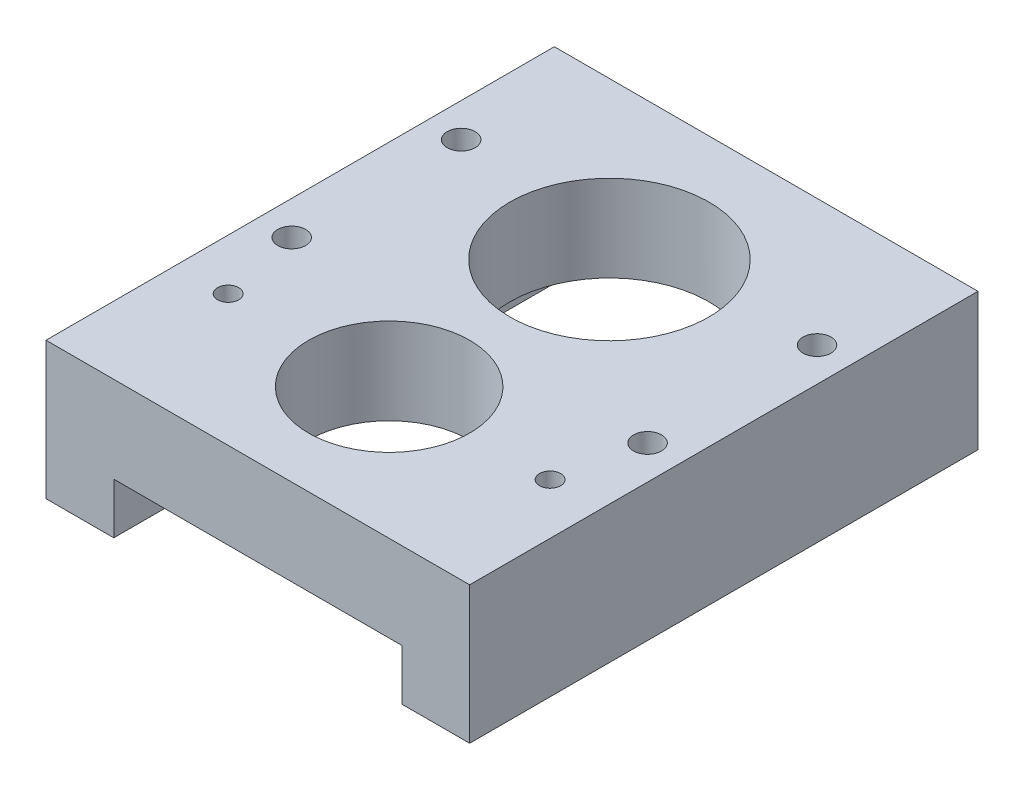
ISO-10303-21;
HEADER;
FILE_DESCRIPTION(('STEP AP214'),'2;1');
FILE_NAME('part.step','',(''),(''),'','','');
FILE_SCHEMA(('AUTOMOTIVE_DESIGN { 1 0 10303 214 1 1 1 1 }'));
ENDSEC;
DATA;
#1=APPLICATION_CONTEXT('core data for automotive mechanical design processes');
#2=APPLICATION_PROTOCOL_DEFINITION('international standard','automotive_design',2000,#1);
#3=PRODUCT_CONTEXT('',#1,'mechanical');
#4=PRODUCT('Part','Part','',(#3));
#5=PRODUCT_RELATED_PRODUCT_CATEGORY('part','',(#4));
#6=PRODUCT_DEFINITION_FORMATION('','',#4);
#7=PRODUCT_DEFINITION_CONTEXT('part definition',#1,'design');
#8=PRODUCT_DEFINITION('design','',#6,#7);
#9=PRODUCT_DEFINITION_SHAPE('','',#8);
#10=(LENGTH_UNIT() NAMED_UNIT(*) SI_UNIT(.MILLI.,.METRE.));
#11=(NAMED_UNIT(*) PLANE_ANGLE_UNIT() SI_UNIT($,.RADIAN.));
#12=(NAMED_UNIT(*) SI_UNIT($,.STERADIAN.) SOLID_ANGLE_UNIT());
#13=UNCERTAINTY_MEASURE_WITH_UNIT(LENGTH_MEASURE(1.E-05),#10,'distance_accuracy_value','');
#14=(GEOMETRIC_REPRESENTATION_CONTEXT(3) GLOBAL_UNCERTAINTY_ASSIGNED_CONTEXT((#13)) GLOBAL_UNIT_ASSIGNED_CONTEXT((#10,
#11,#12)) REPRESENTATION_CONTEXT('',''));
#15=CARTESIAN_POINT('',(0.,0.,0.));
#16=DIRECTION('',(0.,0.,1.));
#17=DIRECTION('',(1.,0.,0.));
#18=AXIS2_PLACEMENT_3D('',#15,#16,#17);
#19=CARTESIAN_POINT('',(-25.,16.2,60.));
#20=DIRECTION('',(1.,0.,0.));
#21=DIRECTION('',(0.,1.,0.));
#22=AXIS2_PLACEMENT_3D('',#19,#20,#21);
#23=PLANE('',#22);
#24=DIRECTION('',(0.,-1.,0.));
#25=VECTOR('',#24,1.);
#26=CARTESIAN_POINT('',(-25.,16.2,0.));
#27=LINE('',#26,#25);
#28=CARTESIAN_POINT('',(-25.,16.2,0.));
#29=VERTEX_POINT('',#28);
#30=CARTESIAN_POINT('',(-25.,0.,0.));
#31=VERTEX_POINT('',#30);
#32=EDGE_CURVE('E136',#29,#31,#27,.T.);
#33=ORIENTED_EDGE('',*,*,#32,.T.);
#34=DIRECTION('',(0.,0.,-1.));
#35=VECTOR('',#34,1.);
#36=CARTESIAN_POINT('',(-25.,0.,60.));
#37=LINE('',#36,#35);
#38=CARTESIAN_POINT('',(-25.,0.,60.));
#39=VERTEX_POINT('',#38);
#40=EDGE_CURVE('E11',#39,#31,#37,.T.);
#41=ORIENTED_EDGE('',*,*,#40,.F.);
#42=DIRECTION('',(0.,-1.,0.));
#43=VECTOR('',#42,1.);
#44=CARTESIAN_POINT('',(-25.,16.2,60.));
#45=LINE('',#44,#43);
#46=CARTESIAN_POINT('',(-25.,16.2,60.));
#47=VERTEX_POINT('',#46);
#48=EDGE_CURVE('E151',#47,#39,#45,.T.);
#49=ORIENTED_EDGE('',*,*,#48,.F.);
#50=DIRECTION('',(0.,0.,-1.));
#51=VECTOR('',#50,1.);
#52=CARTESIAN_POINT('',(-25.,16.2,60.));
#53=LINE('',#52,#51);
#54=EDGE_CURVE('E132',#47,#29,#53,.T.);
#55=ORIENTED_EDGE('',*,*,#54,.T.);
#56=EDGE_LOOP('',(#33,#41,#49,#55));
#57=FACE_BOUND('',#56,.T.);
#58=ADVANCED_FACE('F37',(#57),#23,.F.);
#59=CARTESIAN_POINT('',(-25.,0.,60.));
#60=DIRECTION('',(0.,1.,0.));
#61=DIRECTION('',(0.,0.,1.));
#62=AXIS2_PLACEMENT_3D('',#59,#60,#61);
#63=PLANE('',#62);
#64=CARTESIAN_POINT('',(-21.,0.,15.));
#65=DIRECTION('',(0.,1.,0.));
#66=DIRECTION('',(0.,0.,1.));
#67=AXIS2_PLACEMENT_3D('',#64,#65,#66);
#68=CIRCLE('',#67,1.65);
#69=CARTESIAN_POINT('',(-21.,0.,16.65));
#70=VERTEX_POINT('',#69);
#71=EDGE_CURVE('E213',#70,#70,#68,.F.);
#72=ORIENTED_EDGE('',*,*,#71,.F.);
#73=EDGE_LOOP('',(#72));
#74=FACE_BOUND('',#73,.T.);
#75=CARTESIAN_POINT('',(-21.,0.,35.));
#76=DIRECTION('',(0.,1.,0.));
#77=DIRECTION('',(0.,0.,1.));
#78=AXIS2_PLACEMENT_3D('',#75,#76,#77);
#79=CIRCLE('',#78,1.65);
#80=CARTESIAN_POINT('',(-21.,0.,36.65));
#81=VERTEX_POINT('',#80);
#82=EDGE_CURVE('E207',#81,#81,#79,.F.);
#83=ORIENTED_EDGE('',*,*,#82,.F.);
#84=EDGE_LOOP('',(#83));
#85=FACE_BOUND('',#84,.T.);
#86=DIRECTION('',(1.,0.,0.));
#87=VECTOR('',#86,1.);
#88=CARTESIAN_POINT('',(-25.,0.,0.));
#89=LINE('',#88,#87);
#90=CARTESIAN_POINT('',(-17.,0.,0.));
#91=VERTEX_POINT('',#90);
#92=EDGE_CURVE('E139',#31,#91,#89,.T.);
#93=ORIENTED_EDGE('',*,*,#92,.T.);
#94=DIRECTION('',(0.,0.,-1.));
#95=VECTOR('',#94,1.);
#96=CARTESIAN_POINT('',(-17.,0.,60.));
#97=LINE('',#96,#95);
#98=CARTESIAN_POINT('',(-17.,0.,60.));
#99=VERTEX_POINT('',#98);
#100=EDGE_CURVE('E45',#99,#91,#97,.T.);
#101=ORIENTED_EDGE('',*,*,#100,.F.);
#102=DIRECTION('',(1.,0.,0.));
#103=VECTOR('',#102,1.);
#104=CARTESIAN_POINT('',(-25.,0.,60.));
#105=LINE('',#104,#103);
#106=EDGE_CURVE('E97',#39,#99,#105,.T.);
#107=ORIENTED_EDGE('',*,*,#106,.F.);
#108=ORIENTED_EDGE('',*,*,#40,.T.);
#109=EDGE_LOOP('',(#93,#101,#107,#108));
#110=FACE_BOUND('',#109,.T.);
#111=ADVANCED_FACE('F265',(#74,#85,#110),#63,.F.);
#112=CARTESIAN_POINT('',(-17.,0.,60.));
#113=DIRECTION('',(-1.,0.,0.));
#114=DIRECTION('',(0.,0.,1.));
#115=AXIS2_PLACEMENT_3D('',#112,#113,#114);
#116=PLANE('',#115);
#117=DIRECTION('',(0.,1.,0.));
#118=VECTOR('',#117,1.);
#119=CARTESIAN_POINT('',(-17.,0.,0.));
#120=LINE('',#119,#118);
#121=CARTESIAN_POINT('',(-17.,6.,0.));
#122=VERTEX_POINT('',#121);
#123=EDGE_CURVE('E142',#91,#122,#120,.T.);
#124=ORIENTED_EDGE('',*,*,#123,.T.);
#125=DIRECTION('',(0.,0.,-1.));
#126=VECTOR('',#125,1.);
#127=CARTESIAN_POINT('',(-17.,6.,60.));
#128=LINE('',#127,#126);
#129=CARTESIAN_POINT('',(-17.,6.,60.));
#130=VERTEX_POINT('',#129);
#131=EDGE_CURVE('E158',#130,#122,#128,.T.);
#132=ORIENTED_EDGE('',*,*,#131,.F.);
#133=DIRECTION('',(0.,1.,0.));
#134=VECTOR('',#133,1.);
#135=CARTESIAN_POINT('',(-17.,0.,60.));
#136=LINE('',#135,#134);
#137=EDGE_CURVE('E166',#99,#130,#136,.T.);
#138=ORIENTED_EDGE('',*,*,#137,.F.);
#139=ORIENTED_EDGE('',*,*,#100,.T.);
#140=EDGE_LOOP('',(#124,#132,#138,#139));
#141=FACE_BOUND('',#140,.T.);
#142=ADVANCED_FACE('F164',(#141),#116,.F.);
#143=CARTESIAN_POINT('',(-17.,6.,60.));
#144=DIRECTION('',(0.,1.,0.));
#145=DIRECTION('',(0.,0.,1.));
#146=AXIS2_PLACEMENT_3D('',#143,#144,#145);
#147=PLANE('',#146);
#148=CARTESIAN_POINT('',(0.,6.,44.5));
#149=DIRECTION('',(0.,1.,0.));
#150=DIRECTION('',(0.,0.,1.));
#151=AXIS2_PLACEMENT_3D('',#148,#149,#150);
#152=CIRCLE('',#151,9.5);
#153=CARTESIAN_POINT('',(0.,6.,54.));
#154=VERTEX_POINT('',#153);
#155=EDGE_CURVE('E189',#154,#154,#152,.T.);
#156=ORIENTED_EDGE('',*,*,#155,.T.);
#157=EDGE_LOOP('',(#156));
#158=FACE_BOUND('',#157,.T.);
#159=CARTESIAN_POINT('',(0.,6.,18.5));
#160=DIRECTION('',(0.,1.,0.));
#161=DIRECTION('',(0.,0.,1.));
#162=AXIS2_PLACEMENT_3D('',#159,#160,#161);
#163=CIRCLE('',#162,11.75);
#164=CARTESIAN_POINT('',(0.,6.,30.25));
#165=VERTEX_POINT('',#164);
#166=EDGE_CURVE('E140',#165,#165,#163,.T.);
#167=ORIENTED_EDGE('',*,*,#166,.T.);
#168=EDGE_LOOP('',(#167));
#169=FACE_BOUND('',#168,.T.);
#170=DIRECTION('',(1.,0.,0.));
#171=VECTOR('',#170,1.);
#172=CARTESIAN_POINT('',(-17.,6.,0.));
#173=LINE('',#172,#171);
#174=CARTESIAN_POINT('',(17.,6.,0.));
#175=VERTEX_POINT('',#174);
#176=EDGE_CURVE('E144',#122,#175,#173,.T.);
#177=ORIENTED_EDGE('',*,*,#176,.T.);
#178=DIRECTION('',(0.,0.,-1.));
#179=VECTOR('',#178,1.);
#180=CARTESIAN_POINT('',(17.,6.,60.));
#181=LINE('',#180,#179);
#182=CARTESIAN_POINT('',(17.,6.,60.));
#183=VERTEX_POINT('',#182);
#184=EDGE_CURVE('E155',#183,#175,#181,.T.);
#185=ORIENTED_EDGE('',*,*,#184,.F.);
#186=DIRECTION('',(1.,0.,0.));
#187=VECTOR('',#186,1.);
#188=CARTESIAN_POINT('',(-17.,6.,60.));
#189=LINE('',#188,#187);
#190=EDGE_CURVE('E178',#130,#183,#189,.T.);
#191=ORIENTED_EDGE('',*,*,#190,.F.);
#192=ORIENTED_EDGE('',*,*,#131,.T.);
#193=EDGE_LOOP('',(#177,#185,#191,#192));
#194=FACE_BOUND('',#193,.T.);
#195=ADVANCED_FACE('F174',(#158,#169,#194),#147,.F.);
#196=CARTESIAN_POINT('',(17.,6.,60.));
#197=DIRECTION('',(1.,0.,0.));
#198=DIRECTION('',(0.,0.,-1.));
#199=AXIS2_PLACEMENT_3D('',#196,#197,#198);
#200=PLANE('',#199);
#201=DIRECTION('',(0.,-1.,0.));
#202=VECTOR('',#201,1.);
#203=CARTESIAN_POINT('',(17.,6.,0.));
#204=LINE('',#203,#202);
#205=CARTESIAN_POINT('',(17.,0.,0.));
#206=VERTEX_POINT('',#205);
#207=EDGE_CURVE('E146',#175,#206,#204,.T.);
#208=ORIENTED_EDGE('',*,*,#207,.T.);
#209=DIRECTION('',(0.,0.,-1.));
#210=VECTOR('',#209,1.);
#211=CARTESIAN_POINT('',(17.,0.,60.));
#212=LINE('',#211,#210);
#213=CARTESIAN_POINT('',(17.,0.,60.));
#214=VERTEX_POINT('',#213);
#215=EDGE_CURVE('E127',#214,#206,#212,.T.);
#216=ORIENTED_EDGE('',*,*,#215,.F.);
#217=DIRECTION('',(0.,-1.,0.));
#218=VECTOR('',#217,1.);
#219=CARTESIAN_POINT('',(17.,6.,60.));
#220=LINE('',#219,#218);
#221=EDGE_CURVE('E118',#183,#214,#220,.T.);
#222=ORIENTED_EDGE('',*,*,#221,.F.);
#223=ORIENTED_EDGE('',*,*,#184,.T.);
#224=EDGE_LOOP('',(#208,#216,#222,#223));
#225=FACE_BOUND('',#224,.T.);
#226=ADVANCED_FACE('F177',(#225),#200,.F.);
#227=CARTESIAN_POINT('',(17.,0.,60.));
#228=DIRECTION('',(0.,1.,0.));
#229=DIRECTION('',(0.,0.,1.));
#230=AXIS2_PLACEMENT_3D('',#227,#228,#229);
#231=PLANE('',#230);
#232=CARTESIAN_POINT('',(21.,0.,35.));
#233=DIRECTION('',(0.,1.,0.));
#234=DIRECTION('',(0.,0.,1.));
#235=AXIS2_PLACEMENT_3D('',#232,#233,#234);
#236=CIRCLE('',#235,1.65);
#237=CARTESIAN_POINT('',(21.,0.,36.65));
#238=VERTEX_POINT('',#237);
#239=EDGE_CURVE('E214',#238,#238,#236,.F.);
#240=ORIENTED_EDGE('',*,*,#239,.F.);
#241=EDGE_LOOP('',(#240));
#242=FACE_BOUND('',#241,.T.);
#243=CARTESIAN_POINT('',(21.,0.,15.));
#244=DIRECTION('',(0.,1.,0.));
#245=DIRECTION('',(0.,0.,1.));
#246=AXIS2_PLACEMENT_3D('',#243,#244,#245);
#247=CIRCLE('',#246,1.65);
#248=CARTESIAN_POINT('',(21.,0.,16.65));
#249=VERTEX_POINT('',#248);
#250=EDGE_CURVE('E221',#249,#249,#247,.F.);
#251=ORIENTED_EDGE('',*,*,#250,.F.);
#252=EDGE_LOOP('',(#251));
#253=FACE_BOUND('',#252,.T.);
#254=DIRECTION('',(1.,0.,0.));
#255=VECTOR('',#254,1.);
#256=CARTESIAN_POINT('',(17.,0.,0.));
#257=LINE('',#256,#255);
#258=CARTESIAN_POINT('',(25.,0.,0.));
#259=VERTEX_POINT('',#258);
#260=EDGE_CURVE('E126',#206,#259,#257,.T.);
#261=ORIENTED_EDGE('',*,*,#260,.T.);
#262=DIRECTION('',(0.,0.,-1.));
#263=VECTOR('',#262,1.);
#264=CARTESIAN_POINT('',(25.,0.,60.));
#265=LINE('',#264,#263);
#266=CARTESIAN_POINT('',(25.,0.,60.));
#267=VERTEX_POINT('',#266);
#268=EDGE_CURVE('E123',#267,#259,#265,.T.);
#269=ORIENTED_EDGE('',*,*,#268,.F.);
#270=DIRECTION('',(1.,0.,0.));
#271=VECTOR('',#270,1.);
#272=CARTESIAN_POINT('',(17.,0.,60.));
#273=LINE('',#272,#271);
#274=EDGE_CURVE('E112',#214,#267,#273,.T.);
#275=ORIENTED_EDGE('',*,*,#274,.F.);
#276=ORIENTED_EDGE('',*,*,#215,.T.);
#277=EDGE_LOOP('',(#261,#269,#275,#276));
#278=FACE_BOUND('',#277,.T.);
#279=ADVANCED_FACE('F124',(#242,#253,#278),#231,.F.);
#280=CARTESIAN_POINT('',(25.,0.,60.));
#281=DIRECTION('',(-1.,0.,0.));
#282=DIRECTION('',(0.,-1.,0.));
#283=AXIS2_PLACEMENT_3D('',#280,#281,#282);
#284=PLANE('',#283);
#285=DIRECTION('',(0.,1.,0.));
#286=VECTOR('',#285,1.);
#287=CARTESIAN_POINT('',(25.,0.,0.));
#288=LINE('',#287,#286);
#289=CARTESIAN_POINT('',(25.,16.2,0.));
#290=VERTEX_POINT('',#289);
#291=EDGE_CURVE('E83',#259,#290,#288,.T.);
#292=ORIENTED_EDGE('',*,*,#291,.T.);
#293=DIRECTION('',(0.,0.,-1.));
#294=VECTOR('',#293,1.);
#295=CARTESIAN_POINT('',(25.,16.2,60.));
#296=LINE('',#295,#294);
#297=CARTESIAN_POINT('',(25.,16.2,60.));
#298=VERTEX_POINT('',#297);
#299=EDGE_CURVE('E128',#298,#290,#296,.T.);
#300=ORIENTED_EDGE('',*,*,#299,.F.);
#301=DIRECTION('',(0.,1.,0.));
#302=VECTOR('',#301,1.);
#303=CARTESIAN_POINT('',(25.,0.,60.));
#304=LINE('',#303,#302);
#305=EDGE_CURVE('E116',#267,#298,#304,.T.);
#306=ORIENTED_EDGE('',*,*,#305,.F.);
#307=ORIENTED_EDGE('',*,*,#268,.T.);
#308=EDGE_LOOP('',(#292,#300,#306,#307));
#309=FACE_BOUND('',#308,.T.);
#310=ADVANCED_FACE('F130',(#309),#284,.F.);
#311=CARTESIAN_POINT('',(25.,16.2,60.));
#312=DIRECTION('',(0.,-1.,0.));
#313=DIRECTION('',(1.,0.,0.));
#314=AXIS2_PLACEMENT_3D('',#311,#312,#313);
#315=PLANE('',#314);
#316=CARTESIAN_POINT('',(-21.,16.2,15.));
#317=DIRECTION('',(0.,1.,0.));
#318=DIRECTION('',(-1.,0.,0.));
#319=AXIS2_PLACEMENT_3D('',#316,#317,#318);
#320=CIRCLE('',#319,1.65);
#321=CARTESIAN_POINT('',(-22.65,16.2,15.));
#322=VERTEX_POINT('',#321);
#323=EDGE_CURVE('E217',#322,#322,#320,.T.);
#324=ORIENTED_EDGE('',*,*,#323,.F.);
#325=EDGE_LOOP('',(#324));
#326=FACE_BOUND('',#325,.T.);
#327=CARTESIAN_POINT('',(21.,16.2,35.));
#328=DIRECTION('',(0.,1.,0.));
#329=DIRECTION('',(-1.,0.,0.));
#330=AXIS2_PLACEMENT_3D('',#327,#328,#329);
#331=CIRCLE('',#330,1.65);
#332=CARTESIAN_POINT('',(19.35,16.2,35.));
#333=VERTEX_POINT('',#332);
#334=EDGE_CURVE('E218',#333,#333,#331,.T.);
#335=ORIENTED_EDGE('',*,*,#334,.F.);
#336=EDGE_LOOP('',(#335));
#337=FACE_BOUND('',#336,.T.);
#338=CARTESIAN_POINT('',(21.,16.2,15.));
#339=DIRECTION('',(0.,1.,0.));
#340=DIRECTION('',(-1.,0.,0.));
#341=AXIS2_PLACEMENT_3D('',#338,#339,#340);
#342=CIRCLE('',#341,1.65);
#343=CARTESIAN_POINT('',(19.35,16.2,15.));
#344=VERTEX_POINT('',#343);
#345=EDGE_CURVE('E228',#344,#344,#342,.T.);
#346=ORIENTED_EDGE('',*,*,#345,.F.);
#347=EDGE_LOOP('',(#346));
#348=FACE_BOUND('',#347,.T.);
#349=CARTESIAN_POINT('',(-21.,16.2,35.));
#350=DIRECTION('',(0.,1.,0.));
#351=DIRECTION('',(-1.,0.,0.));
#352=AXIS2_PLACEMENT_3D('',#349,#350,#351);
#353=CIRCLE('',#352,1.65);
#354=CARTESIAN_POINT('',(-22.65,16.2,35.));
#355=VERTEX_POINT('',#354);
#356=EDGE_CURVE('E210',#355,#355,#353,.T.);
#357=ORIENTED_EDGE('',*,*,#356,.F.);
#358=EDGE_LOOP('',(#357));
#359=FACE_BOUND('',#358,.T.);
#360=CARTESIAN_POINT('',(19.,16.2,44.5));
#361=DIRECTION('',(0.,1.,0.));
#362=DIRECTION('',(0.,0.,1.));
#363=AXIS2_PLACEMENT_3D('',#360,#361,#362);
#364=CIRCLE('',#363,1.24999999999999);
#365=CARTESIAN_POINT('',(19.,16.2,45.75));
#366=VERTEX_POINT('',#365);
#367=EDGE_CURVE('E204',#366,#366,#364,.T.);
#368=ORIENTED_EDGE('',*,*,#367,.F.);
#369=EDGE_LOOP('',(#368));
#370=FACE_BOUND('',#369,.T.);
#371=CARTESIAN_POINT('',(-19.,16.2,44.5));
#372=DIRECTION('',(0.,1.,0.));
#373=DIRECTION('',(0.,0.,1.));
#374=AXIS2_PLACEMENT_3D('',#371,#372,#373);
#375=CIRCLE('',#374,1.24999999999999);
#376=CARTESIAN_POINT('',(-19.,16.2,45.75));
#377=VERTEX_POINT('',#376);
#378=EDGE_CURVE('E198',#377,#377,#375,.T.);
#379=ORIENTED_EDGE('',*,*,#378,.F.);
#380=EDGE_LOOP('',(#379));
#381=FACE_BOUND('',#380,.T.);
#382=CARTESIAN_POINT('',(0.,16.2,44.5));
#383=DIRECTION('',(0.,1.,0.));
#384=DIRECTION('',(-1.,0.,0.));
#385=AXIS2_PLACEMENT_3D('',#382,#383,#384);
#386=CIRCLE('',#385,9.5);
#387=CARTESIAN_POINT('',(-9.5,16.2,44.5));
#388=VERTEX_POINT('',#387);
#389=EDGE_CURVE('E192',#388,#388,#386,.T.);
#390=ORIENTED_EDGE('',*,*,#389,.F.);
#391=EDGE_LOOP('',(#390));
#392=FACE_BOUND('',#391,.T.);
#393=CARTESIAN_POINT('',(0.,16.2,18.5));
#394=DIRECTION('',(0.,1.,0.));
#395=DIRECTION('',(-1.,0.,0.));
#396=AXIS2_PLACEMENT_3D('',#393,#394,#395);
#397=CIRCLE('',#396,11.75);
#398=CARTESIAN_POINT('',(-11.75,16.2,18.5));
#399=VERTEX_POINT('',#398);
#400=EDGE_CURVE('E186',#399,#399,#397,.T.);
#401=ORIENTED_EDGE('',*,*,#400,.F.);
#402=EDGE_LOOP('',(#401));
#403=FACE_BOUND('',#402,.T.);
#404=DIRECTION('',(-1.,0.,0.));
#405=VECTOR('',#404,1.);
#406=CARTESIAN_POINT('',(25.,16.2,0.));
#407=LINE('',#406,#405);
#408=EDGE_CURVE('E89',#290,#29,#407,.T.);
#409=ORIENTED_EDGE('',*,*,#408,.T.);
#410=ORIENTED_EDGE('',*,*,#54,.F.);
#411=DIRECTION('',(-1.,0.,0.));
#412=VECTOR('',#411,1.);
#413=CARTESIAN_POINT('',(25.,16.2,60.));
#414=LINE('',#413,#412);
#415=EDGE_CURVE('E53',#298,#47,#414,.T.);
#416=ORIENTED_EDGE('',*,*,#415,.F.);
#417=ORIENTED_EDGE('',*,*,#299,.T.);
#418=EDGE_LOOP('',(#409,#410,#416,#417));
#419=FACE_BOUND('',#418,.T.);
#420=ADVANCED_FACE('F235',(#326,#337,#348,#359,#370,#381,#392,#403,#419),#315,.F.);
#421=CARTESIAN_POINT('',(0.,0.,60.));
#422=DIRECTION('',(0.,0.,1.));
#423=DIRECTION('',(1.,0.,0.));
#424=AXIS2_PLACEMENT_3D('',#421,#422,#423);
#425=PLANE('',#424);
#426=ORIENTED_EDGE('',*,*,#48,.T.);
#427=ORIENTED_EDGE('',*,*,#106,.T.);
#428=ORIENTED_EDGE('',*,*,#137,.T.);
#429=ORIENTED_EDGE('',*,*,#190,.T.);
#430=ORIENTED_EDGE('',*,*,#221,.T.);
#431=ORIENTED_EDGE('',*,*,#274,.T.);
#432=ORIENTED_EDGE('',*,*,#305,.T.);
#433=ORIENTED_EDGE('',*,*,#415,.T.);
#434=EDGE_LOOP('',(#426,#427,#428,#429,#430,#431,#432,#433));
#435=FACE_BOUND('',#434,.T.);
#436=ADVANCED_FACE('F114',(#435),#425,.T.);
#437=CARTESIAN_POINT('',(0.,0.,0.));
#438=DIRECTION('',(0.,0.,1.));
#439=DIRECTION('',(1.,0.,0.));
#440=AXIS2_PLACEMENT_3D('',#437,#438,#439);
#441=PLANE('',#440);
#442=ORIENTED_EDGE('',*,*,#32,.F.);
#443=ORIENTED_EDGE('',*,*,#408,.F.);
#444=ORIENTED_EDGE('',*,*,#291,.F.);
#445=ORIENTED_EDGE('',*,*,#260,.F.);
#446=ORIENTED_EDGE('',*,*,#207,.F.);
#447=ORIENTED_EDGE('',*,*,#176,.F.);
#448=ORIENTED_EDGE('',*,*,#123,.F.);
#449=ORIENTED_EDGE('',*,*,#92,.F.);
#450=EDGE_LOOP('',(#442,#443,#444,#445,#446,#447,#448,#449));
#451=FACE_BOUND('',#450,.T.);
#452=ADVANCED_FACE('F170',(#451),#441,.F.);
#453=CARTESIAN_POINT('',(0.,-23.8,18.5));
#454=DIRECTION('',(0.,1.,0.));
#455=DIRECTION('',(-1.,0.,0.));
#456=AXIS2_PLACEMENT_3D('',#453,#454,#455);
#457=CYLINDRICAL_SURFACE('',#456,11.75);
#458=ORIENTED_EDGE('',*,*,#400,.T.);
#459=EDGE_LOOP('',(#458));
#460=FACE_BOUND('',#459,.T.);
#461=ORIENTED_EDGE('',*,*,#166,.F.);
#462=EDGE_LOOP('',(#461));
#463=FACE_BOUND('',#462,.T.);
#464=ADVANCED_FACE('F250',(#460,#463),#457,.F.);
#465=CARTESIAN_POINT('',(0.,-23.8,44.5));
#466=DIRECTION('',(0.,1.,0.));
#467=DIRECTION('',(-1.,0.,0.));
#468=AXIS2_PLACEMENT_3D('',#465,#466,#467);
#469=CYLINDRICAL_SURFACE('',#468,9.5);
#470=ORIENTED_EDGE('',*,*,#389,.T.);
#471=EDGE_LOOP('',(#470));
#472=FACE_BOUND('',#471,.T.);
#473=ORIENTED_EDGE('',*,*,#155,.F.);
#474=EDGE_LOOP('',(#473));
#475=FACE_BOUND('',#474,.T.);
#476=ADVANCED_FACE('F253',(#472,#475),#469,.F.);
#477=CARTESIAN_POINT('',(-19.,11.2,44.5));
#478=DIRECTION('',(0.,1.,0.));
#479=DIRECTION('',(0.,0.,1.));
#480=AXIS2_PLACEMENT_3D('',#477,#478,#479);
#481=CONICAL_SURFACE('',#480,1.25,1.02974425867665);
#482=CARTESIAN_POINT('',(-19.,10.4489242262155,44.5));
#483=VERTEX_POINT('',#482);
#484=VERTEX_LOOP('',#483);
#485=FACE_BOUND('',#484,.T.);
#486=CARTESIAN_POINT('',(-19.,11.2,44.5));
#487=DIRECTION('',(0.,1.,0.));
#488=DIRECTION('',(0.,0.,1.));
#489=AXIS2_PLACEMENT_3D('',#486,#487,#488);
#490=CIRCLE('',#489,1.25);
#491=CARTESIAN_POINT('',(-19.,11.2,45.75));
#492=VERTEX_POINT('',#491);
#493=EDGE_CURVE('E195',#492,#492,#490,.T.);
#494=ORIENTED_EDGE('',*,*,#493,.T.);
#495=EDGE_LOOP('',(#494));
#496=FACE_BOUND('',#495,.T.);
#497=ADVANCED_FACE('F304',(#485,#496),#481,.F.);
#498=CARTESIAN_POINT('',(-19.,16.2,44.5));
#499=DIRECTION('',(0.,1.,0.));
#500=DIRECTION('',(0.,0.,1.));
#501=AXIS2_PLACEMENT_3D('',#498,#499,#500);
#502=CYLINDRICAL_SURFACE('',#501,1.24999999999999);
#503=ORIENTED_EDGE('',*,*,#493,.F.);
#504=EDGE_LOOP('',(#503));
#505=FACE_BOUND('',#504,.T.);
#506=ORIENTED_EDGE('',*,*,#378,.T.);
#507=EDGE_LOOP('',(#506));
#508=FACE_BOUND('',#507,.T.);
#509=ADVANCED_FACE('F300',(#505,#508),#502,.F.);
#510=CARTESIAN_POINT('',(19.,11.2,44.5));
#511=DIRECTION('',(0.,1.,0.));
#512=DIRECTION('',(0.,0.,1.));
#513=AXIS2_PLACEMENT_3D('',#510,#511,#512);
#514=CONICAL_SURFACE('',#513,1.25,1.02974425867665);
#515=CARTESIAN_POINT('',(19.,10.4489242262156,44.5));
#516=VERTEX_POINT('',#515);
#517=VERTEX_LOOP('',#516);
#518=FACE_BOUND('',#517,.T.);
#519=CARTESIAN_POINT('',(19.,11.2,44.5));
#520=DIRECTION('',(0.,1.,0.));
#521=DIRECTION('',(0.,0.,1.));
#522=AXIS2_PLACEMENT_3D('',#519,#520,#521);
#523=CIRCLE('',#522,1.25);
#524=CARTESIAN_POINT('',(19.,11.2,45.75));
#525=VERTEX_POINT('',#524);
#526=EDGE_CURVE('E201',#525,#525,#523,.T.);
#527=ORIENTED_EDGE('',*,*,#526,.T.);
#528=EDGE_LOOP('',(#527));
#529=FACE_BOUND('',#528,.T.);
#530=ADVANCED_FACE('F292',(#518,#529),#514,.F.);
#531=CARTESIAN_POINT('',(19.,16.2,44.5));
#532=DIRECTION('',(0.,1.,0.));
#533=DIRECTION('',(0.,0.,1.));
#534=AXIS2_PLACEMENT_3D('',#531,#532,#533);
#535=CYLINDRICAL_SURFACE('',#534,1.24999999999999);
#536=ORIENTED_EDGE('',*,*,#526,.F.);
#537=EDGE_LOOP('',(#536));
#538=FACE_BOUND('',#537,.T.);
#539=ORIENTED_EDGE('',*,*,#367,.T.);
#540=EDGE_LOOP('',(#539));
#541=FACE_BOUND('',#540,.T.);
#542=ADVANCED_FACE('F283',(#538,#541),#535,.F.);
#543=CARTESIAN_POINT('',(-21.,-0.00100000000000794,35.));
#544=DIRECTION('',(0.,1.,0.));
#545=DIRECTION('',(-1.,0.,0.));
#546=AXIS2_PLACEMENT_3D('',#543,#544,#545);
#547=CYLINDRICAL_SURFACE('',#546,1.65);
#548=ORIENTED_EDGE('',*,*,#356,.T.);
#549=EDGE_LOOP('',(#548));
#550=FACE_BOUND('',#549,.T.);
#551=ORIENTED_EDGE('',*,*,#82,.T.);
#552=EDGE_LOOP('',(#551));
#553=FACE_BOUND('',#552,.T.);
#554=ADVANCED_FACE('F281',(#550,#553),#547,.F.);
#555=CARTESIAN_POINT('',(21.,-0.001000000000001,15.));
#556=DIRECTION('',(0.,1.,0.));
#557=DIRECTION('',(-1.,0.,0.));
#558=AXIS2_PLACEMENT_3D('',#555,#556,#557);
#559=CYLINDRICAL_SURFACE('',#558,1.65);
#560=ORIENTED_EDGE('',*,*,#345,.T.);
#561=EDGE_LOOP('',(#560));
#562=FACE_BOUND('',#561,.T.);
#563=ORIENTED_EDGE('',*,*,#250,.T.);
#564=EDGE_LOOP('',(#563));
#565=FACE_BOUND('',#564,.T.);
#566=ADVANCED_FACE('F232',(#562,#565),#559,.F.);
#567=CARTESIAN_POINT('',(21.,-0.001000000000001,35.));
#568=DIRECTION('',(0.,1.,0.));
#569=DIRECTION('',(-1.,0.,0.));
#570=AXIS2_PLACEMENT_3D('',#567,#568,#569);
#571=CYLINDRICAL_SURFACE('',#570,1.65);
#572=ORIENTED_EDGE('',*,*,#334,.T.);
#573=EDGE_LOOP('',(#572));
#574=FACE_BOUND('',#573,.T.);
#575=ORIENTED_EDGE('',*,*,#239,.T.);
#576=EDGE_LOOP('',(#575));
#577=FACE_BOUND('',#576,.T.);
#578=ADVANCED_FACE('F290',(#574,#577),#571,.F.);
#579=CARTESIAN_POINT('',(-21.,-0.00100000000000794,15.));
#580=DIRECTION('',(0.,1.,0.));
#581=DIRECTION('',(-1.,0.,0.));
#582=AXIS2_PLACEMENT_3D('',#579,#580,#581);
#583=CYLINDRICAL_SURFACE('',#582,1.65);
#584=ORIENTED_EDGE('',*,*,#323,.T.);
#585=EDGE_LOOP('',(#584));
#586=FACE_BOUND('',#585,.T.);
#587=ORIENTED_EDGE('',*,*,#71,.T.);
#588=EDGE_LOOP('',(#587));
#589=FACE_BOUND('',#588,.T.);
#590=ADVANCED_FACE('F327',(#586,#589),#583,.F.);
#591=CLOSED_SHELL('',(#58,#111,#142,#195,#226,#279,#310,#420,#436,#452,#464,#476,#497,#509,#530,
#542,#554,#566,#578,#590));
#592=MANIFOLD_SOLID_BREP('B2',#591);
#593=ADVANCED_BREP_SHAPE_REPRESENTATION('',(#18,#592),#14);
#594=SHAPE_DEFINITION_REPRESENTATION(#9,#593);
ENDSEC;
END-ISO-10303-21;
